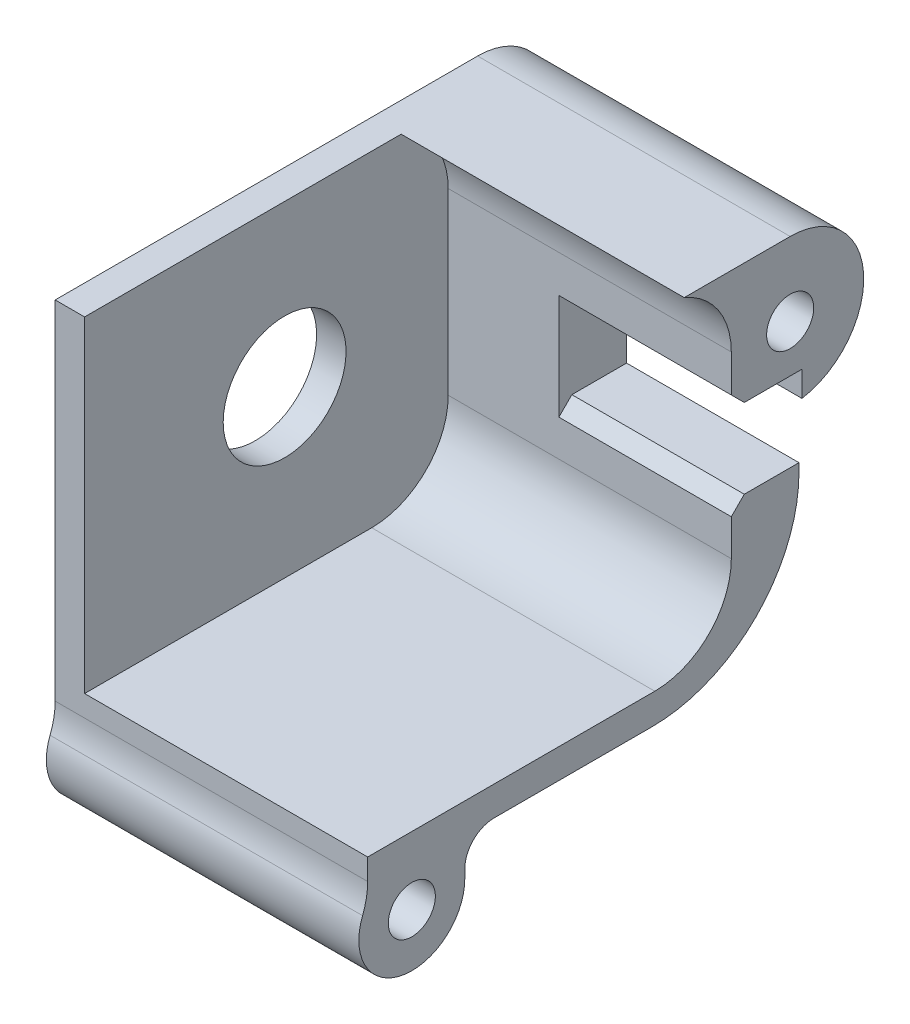
ISO-10303-21;
HEADER;
FILE_DESCRIPTION(('STEP AP214'),'2;1');
FILE_NAME('part.step','',(''),(''),'','','');
FILE_SCHEMA(('AUTOMOTIVE_DESIGN { 1 0 10303 214 1 1 1 1 }'));
ENDSEC;
DATA;
#1=APPLICATION_CONTEXT('core data for automotive mechanical design processes');
#2=APPLICATION_PROTOCOL_DEFINITION('international standard','automotive_design',2000,#1);
#3=PRODUCT_CONTEXT('',#1,'mechanical');
#4=PRODUCT('Part','Part','',(#3));
#5=PRODUCT_RELATED_PRODUCT_CATEGORY('part','',(#4));
#6=PRODUCT_DEFINITION_FORMATION('','',#4);
#7=PRODUCT_DEFINITION_CONTEXT('part definition',#1,'design');
#8=PRODUCT_DEFINITION('design','',#6,#7);
#9=PRODUCT_DEFINITION_SHAPE('','',#8);
#10=(LENGTH_UNIT() NAMED_UNIT(*) SI_UNIT(.MILLI.,.METRE.));
#11=(NAMED_UNIT(*) PLANE_ANGLE_UNIT() SI_UNIT($,.RADIAN.));
#12=(NAMED_UNIT(*) SI_UNIT($,.STERADIAN.) SOLID_ANGLE_UNIT());
#13=UNCERTAINTY_MEASURE_WITH_UNIT(LENGTH_MEASURE(1.E-05),#10,'distance_accuracy_value','');
#14=(GEOMETRIC_REPRESENTATION_CONTEXT(3) GLOBAL_UNCERTAINTY_ASSIGNED_CONTEXT((#13)) GLOBAL_UNIT_ASSIGNED_CONTEXT((#10,
#11,#12)) REPRESENTATION_CONTEXT('',''));
#15=CARTESIAN_POINT('',(0.,0.,0.));
#16=DIRECTION('',(0.,0.,1.));
#17=DIRECTION('',(1.,0.,0.));
#18=AXIS2_PLACEMENT_3D('',#15,#16,#17);
#19=CARTESIAN_POINT('',(-6497.9588402677,-3116.42691806672,-792.467150495456));
#20=DIRECTION('',(-1.,0.,0.));
#21=DIRECTION('',(0.,0.,1.));
#22=AXIS2_PLACEMENT_3D('',#19,#20,#21);
#23=CYLINDRICAL_SURFACE('',#22,1.59999999999944);
#24=CARTESIAN_POINT('',(-6553.50165117167,-3116.42691806672,-792.467150495456));
#25=DIRECTION('',(-1.,0.,0.));
#26=DIRECTION('',(0.,0.,1.));
#27=AXIS2_PLACEMENT_3D('',#24,#25,#26);
#28=CIRCLE('',#27,1.59999999999944);
#29=CARTESIAN_POINT('',(-6553.50165117167,-3116.42691806672,-790.867150495457));
#30=VERTEX_POINT('',#29);
#31=EDGE_CURVE('E455',#30,#30,#28,.T.);
#32=ORIENTED_EDGE('',*,*,#31,.T.);
#33=EDGE_LOOP('',(#32));
#34=FACE_BOUND('',#33,.T.);
#35=CARTESIAN_POINT('',(-6532.26164814562,-3116.42691806672,-792.467150495456));
#36=DIRECTION('',(-1.,0.,0.));
#37=DIRECTION('',(0.,0.,1.));
#38=AXIS2_PLACEMENT_3D('',#35,#36,#37);
#39=CIRCLE('',#38,1.59999999999944);
#40=CARTESIAN_POINT('',(-6532.26164814562,-3116.42691806672,-790.867150495457));
#41=VERTEX_POINT('',#40);
#42=EDGE_CURVE('E398',#41,#41,#39,.T.);
#43=ORIENTED_EDGE('',*,*,#42,.F.);
#44=EDGE_LOOP('',(#43));
#45=FACE_BOUND('',#44,.T.);
#46=ADVANCED_FACE('F205',(#34,#45),#23,.F.);
#47=CARTESIAN_POINT('',(-6497.9588402677,-3125.59483922505,-783.067150495456));
#48=DIRECTION('',(-1.,0.,0.));
#49=DIRECTION('',(0.,0.,1.));
#50=AXIS2_PLACEMENT_3D('',#47,#48,#49);
#51=CYLINDRICAL_SURFACE('',#50,9.9999999999999);
#52=DIRECTION('',(-1.,0.,0.));
#53=VECTOR('',#52,1.);
#54=CARTESIAN_POINT('',(-6497.9588402677,-3125.59483922505,-793.067150495456));
#55=LINE('',#54,#53);
#56=CARTESIAN_POINT('',(-6532.26164814562,-3125.59483922505,-793.067150495456));
#57=VERTEX_POINT('',#56);
#58=CARTESIAN_POINT('',(-6553.50165117167,-3125.59483922505,-793.067150495456));
#59=VERTEX_POINT('',#58);
#60=EDGE_CURVE('E209',#57,#59,#55,.T.);
#61=ORIENTED_EDGE('',*,*,#60,.F.);
#62=CARTESIAN_POINT('',(-6532.26164814562,-3125.59483922505,-783.067150495456));
#63=DIRECTION('',(-1.,0.,0.));
#64=DIRECTION('',(0.,0.,1.));
#65=AXIS2_PLACEMENT_3D('',#62,#63,#64);
#66=CIRCLE('',#65,9.9999999999999);
#67=CARTESIAN_POINT('',(-6532.26164814562,-3135.59483922505,-783.067150495456));
#68=VERTEX_POINT('',#67);
#69=EDGE_CURVE('E437',#57,#68,#66,.T.);
#70=ORIENTED_EDGE('',*,*,#69,.T.);
#71=DIRECTION('',(-1.,0.,0.));
#72=VECTOR('',#71,1.);
#73=CARTESIAN_POINT('',(-6497.9588402677,-3135.59483922505,-783.067150495456));
#74=LINE('',#73,#72);
#75=CARTESIAN_POINT('',(-6553.50165117167,-3135.59483922505,-783.067150495456));
#76=VERTEX_POINT('',#75);
#77=EDGE_CURVE('E539',#68,#76,#74,.T.);
#78=ORIENTED_EDGE('',*,*,#77,.T.);
#79=CARTESIAN_POINT('',(-6553.50165117167,-3125.59483922505,-783.067150495456));
#80=DIRECTION('',(-1.,0.,0.));
#81=DIRECTION('',(0.,0.,1.));
#82=AXIS2_PLACEMENT_3D('',#79,#80,#81);
#83=CIRCLE('',#82,9.9999999999999);
#84=EDGE_CURVE('E472',#59,#76,#83,.T.);
#85=ORIENTED_EDGE('',*,*,#84,.F.);
#86=EDGE_LOOP('',(#61,#70,#78,#85));
#87=FACE_BOUND('',#86,.T.);
#88=ADVANCED_FACE('F554',(#87),#51,.T.);
#89=CARTESIAN_POINT('',(-6497.9588402677,-3135.59483922505,0.));
#90=DIRECTION('',(0.,1.,0.));
#91=DIRECTION('',(0.,0.,1.));
#92=AXIS2_PLACEMENT_3D('',#89,#90,#91);
#93=PLANE('',#92);
#94=ORIENTED_EDGE('',*,*,#77,.F.);
#95=DIRECTION('',(0.,0.,-1.));
#96=VECTOR('',#95,1.);
#97=CARTESIAN_POINT('',(-6532.26164814562,-3135.59483922505,-793.067150495456));
#98=LINE('',#97,#96);
#99=CARTESIAN_POINT('',(-6532.26164814562,-3135.59483922505,-772.352150495456));
#100=VERTEX_POINT('',#99);
#101=EDGE_CURVE('E443',#100,#68,#98,.T.);
#102=ORIENTED_EDGE('',*,*,#101,.F.);
#103=DIRECTION('',(-1.,0.,0.));
#104=VECTOR('',#103,1.);
#105=CARTESIAN_POINT('',(-6497.9588402677,-3135.59483922505,-772.352150495456));
#106=LINE('',#105,#104);
#107=CARTESIAN_POINT('',(-6553.50165117167,-3135.59483922505,-772.352150495456));
#108=VERTEX_POINT('',#107);
#109=EDGE_CURVE('E538',#100,#108,#106,.T.);
#110=ORIENTED_EDGE('',*,*,#109,.T.);
#111=DIRECTION('',(0.,0.,1.));
#112=VECTOR('',#111,1.);
#113=CARTESIAN_POINT('',(-6553.50165117167,-3135.59483922505,0.));
#114=LINE('',#113,#112);
#115=EDGE_CURVE('E468',#76,#108,#114,.T.);
#116=ORIENTED_EDGE('',*,*,#115,.F.);
#117=EDGE_LOOP('',(#94,#102,#110,#116));
#118=FACE_BOUND('',#117,.T.);
#119=ADVANCED_FACE('F556',(#118),#93,.F.);
#120=CARTESIAN_POINT('',(-6497.9588402677,-3137.59483922505,-772.352150495456));
#121=DIRECTION('',(-1.,0.,0.));
#122=DIRECTION('',(0.,0.,1.));
#123=AXIS2_PLACEMENT_3D('',#120,#121,#122);
#124=CYLINDRICAL_SURFACE('',#123,1.99999999999989);
#125=ORIENTED_EDGE('',*,*,#109,.F.);
#126=CARTESIAN_POINT('',(-6532.26164814562,-3137.59483922505,-772.352150495456));
#127=DIRECTION('',(-1.,0.,0.));
#128=DIRECTION('',(0.,0.,1.));
#129=AXIS2_PLACEMENT_3D('',#126,#127,#128);
#130=CIRCLE('',#129,1.99999999999989);
#131=CARTESIAN_POINT('',(-6532.26164814562,-3137.59483922505,-770.352150495456));
#132=VERTEX_POINT('',#131);
#133=EDGE_CURVE('E440',#132,#100,#130,.T.);
#134=ORIENTED_EDGE('',*,*,#133,.F.);
#135=DIRECTION('',(-1.,0.,0.));
#136=VECTOR('',#135,1.);
#137=CARTESIAN_POINT('',(-6497.9588402677,-3137.59483922505,-770.352150495456));
#138=LINE('',#137,#136);
#139=CARTESIAN_POINT('',(-6553.50165117167,-3137.59483922505,-770.352150495456));
#140=VERTEX_POINT('',#139);
#141=EDGE_CURVE('E536',#132,#140,#138,.T.);
#142=ORIENTED_EDGE('',*,*,#141,.T.);
#143=CARTESIAN_POINT('',(-6553.50165117167,-3137.59483922505,-772.352150495456));
#144=DIRECTION('',(-1.,0.,0.));
#145=DIRECTION('',(0.,0.,1.));
#146=AXIS2_PLACEMENT_3D('',#143,#144,#145);
#147=CIRCLE('',#146,1.99999999999989);
#148=EDGE_CURVE('E465',#140,#108,#147,.T.);
#149=ORIENTED_EDGE('',*,*,#148,.T.);
#150=EDGE_LOOP('',(#125,#134,#142,#149));
#151=FACE_BOUND('',#150,.T.);
#152=ADVANCED_FACE('F561',(#151),#124,.F.);
#153=CARTESIAN_POINT('',(-6497.9588402677,0.,-770.352150495456));
#154=DIRECTION('',(0.,0.,1.));
#155=DIRECTION('',(1.,0.,0.));
#156=AXIS2_PLACEMENT_3D('',#153,#154,#155);
#157=PLANE('',#156);
#158=ORIENTED_EDGE('',*,*,#141,.F.);
#159=DIRECTION('',(0.,1.,0.));
#160=VECTOR('',#159,1.);
#161=CARTESIAN_POINT('',(-6532.26164814562,-3124.84191806672,-770.352150495456));
#162=LINE('',#161,#160);
#163=CARTESIAN_POINT('',(-6532.26164814562,-3138.19483922505,-770.352150495456));
#164=VERTEX_POINT('',#163);
#165=EDGE_CURVE('E434',#164,#132,#162,.T.);
#166=ORIENTED_EDGE('',*,*,#165,.F.);
#167=DIRECTION('',(-1.,0.,0.));
#168=VECTOR('',#167,1.);
#169=CARTESIAN_POINT('',(-6497.9588402677,-3138.19483922505,-770.352150495456));
#170=LINE('',#169,#168);
#171=CARTESIAN_POINT('',(-6553.50165117167,-3138.19483922505,-770.352150495456));
#172=VERTEX_POINT('',#171);
#173=EDGE_CURVE('E534',#164,#172,#170,.T.);
#174=ORIENTED_EDGE('',*,*,#173,.T.);
#175=DIRECTION('',(0.,-1.,0.));
#176=VECTOR('',#175,1.);
#177=CARTESIAN_POINT('',(-6553.50165117167,0.,-770.352150495456));
#178=LINE('',#177,#176);
#179=EDGE_CURVE('E492',#140,#172,#178,.T.);
#180=ORIENTED_EDGE('',*,*,#179,.F.);
#181=EDGE_LOOP('',(#158,#166,#174,#180));
#182=FACE_BOUND('',#181,.T.);
#183=ADVANCED_FACE('F569',(#182),#157,.F.);
#184=CARTESIAN_POINT('',(-6497.9588402677,-3138.19483922505,-766.752150495456));
#185=DIRECTION('',(-1.,0.,0.));
#186=DIRECTION('',(0.,0.,1.));
#187=AXIS2_PLACEMENT_3D('',#184,#185,#186);
#188=CYLINDRICAL_SURFACE('',#187,3.6000000000001);
#189=ORIENTED_EDGE('',*,*,#173,.F.);
#190=CARTESIAN_POINT('',(-6532.26164814562,-3138.19483922505,-766.752150495456));
#191=DIRECTION('',(-1.,0.,0.));
#192=DIRECTION('',(0.,0.,1.));
#193=AXIS2_PLACEMENT_3D('',#190,#191,#192);
#194=CIRCLE('',#193,3.6000000000001);
#195=CARTESIAN_POINT('',(-6532.26164814562,-3136.87374522931,-763.403313286154));
#196=VERTEX_POINT('',#195);
#197=EDGE_CURVE('E412',#164,#196,#194,.T.);
#198=ORIENTED_EDGE('',*,*,#197,.T.);
#199=DIRECTION('',(-1.,0.,0.));
#200=VECTOR('',#199,1.);
#201=CARTESIAN_POINT('',(-6497.9588402677,-3136.87374522931,-763.403313286154));
#202=LINE('',#201,#200);
#203=CARTESIAN_POINT('',(-6553.50165117167,-3136.87374522931,-763.403313286154));
#204=VERTEX_POINT('',#203);
#205=EDGE_CURVE('E532',#196,#204,#202,.T.);
#206=ORIENTED_EDGE('',*,*,#205,.T.);
#207=CARTESIAN_POINT('',(-6553.50165117167,-3138.19483922505,-766.752150495456));
#208=DIRECTION('',(-1.,0.,0.));
#209=DIRECTION('',(0.,0.,1.));
#210=AXIS2_PLACEMENT_3D('',#207,#208,#209);
#211=CIRCLE('',#210,3.6000000000001);
#212=EDGE_CURVE('E489',#172,#204,#211,.T.);
#213=ORIENTED_EDGE('',*,*,#212,.F.);
#214=EDGE_LOOP('',(#189,#198,#206,#213));
#215=FACE_BOUND('',#214,.T.);
#216=ADVANCED_FACE('F573',(#215),#188,.T.);
#217=CARTESIAN_POINT('',(-6497.9588402677,-3135.03889245744,-758.752150495456));
#218=DIRECTION('',(-1.,0.,0.));
#219=DIRECTION('',(0.,0.,1.));
#220=AXIS2_PLACEMENT_3D('',#217,#218,#219);
#221=CYLINDRICAL_SURFACE('',#220,4.99999999999993);
#222=ORIENTED_EDGE('',*,*,#205,.F.);
#223=CARTESIAN_POINT('',(-6532.26164814562,-3135.03889245744,-758.752150495456));
#224=DIRECTION('',(-1.,0.,0.));
#225=DIRECTION('',(0.,0.,1.));
#226=AXIS2_PLACEMENT_3D('',#223,#224,#225);
#227=CIRCLE('',#226,4.99999999999993);
#228=CARTESIAN_POINT('',(-6532.26164814562,-3135.03889245744,-763.752150495456));
#229=VERTEX_POINT('',#228);
#230=EDGE_CURVE('E431',#229,#196,#227,.T.);
#231=ORIENTED_EDGE('',*,*,#230,.F.);
#232=DIRECTION('',(-1.,0.,0.));
#233=VECTOR('',#232,1.);
#234=CARTESIAN_POINT('',(-6497.9588402677,-3135.03889245744,-763.752150495456));
#235=LINE('',#234,#233);
#236=CARTESIAN_POINT('',(-6553.50165117167,-3135.03889245744,-763.752150495456));
#237=VERTEX_POINT('',#236);
#238=EDGE_CURVE('E530',#229,#237,#235,.T.);
#239=ORIENTED_EDGE('',*,*,#238,.T.);
#240=CARTESIAN_POINT('',(-6553.50165117167,-3135.03889245744,-758.752150495456));
#241=DIRECTION('',(-1.,0.,0.));
#242=DIRECTION('',(0.,0.,1.));
#243=AXIS2_PLACEMENT_3D('',#240,#241,#242);
#244=CIRCLE('',#243,4.99999999999993);
#245=EDGE_CURVE('E486',#237,#204,#244,.T.);
#246=ORIENTED_EDGE('',*,*,#245,.T.);
#247=EDGE_LOOP('',(#222,#231,#239,#246));
#248=FACE_BOUND('',#247,.T.);
#249=ADVANCED_FACE('F577',(#248),#221,.F.);
#250=CARTESIAN_POINT('',(-6497.9588402677,0.,-763.752150495456));
#251=DIRECTION('',(0.,0.,-1.));
#252=DIRECTION('',(-1.,0.,0.));
#253=AXIS2_PLACEMENT_3D('',#250,#251,#252);
#254=PLANE('',#253);
#255=ORIENTED_EDGE('',*,*,#238,.F.);
#256=DIRECTION('',(0.,-1.,0.));
#257=VECTOR('',#256,1.);
#258=CARTESIAN_POINT('',(-6532.26164814562,-3124.84191806672,-763.752150495456));
#259=LINE('',#258,#257);
#260=CARTESIAN_POINT('',(-6532.26164814562,-3133.59483922505,-763.752150495456));
#261=VERTEX_POINT('',#260);
#262=EDGE_CURVE('E428',#261,#229,#259,.T.);
#263=ORIENTED_EDGE('',*,*,#262,.F.);
#264=DIRECTION('',(-1.,0.,0.));
#265=VECTOR('',#264,1.);
#266=CARTESIAN_POINT('',(-6497.9588402677,-3133.59483922505,-763.752150495456));
#267=LINE('',#266,#265);
#268=CARTESIAN_POINT('',(-6551.50165117167,-3133.59483922505,-763.752150495456));
#269=VERTEX_POINT('',#268);
#270=EDGE_CURVE('E528',#261,#269,#267,.T.);
#271=ORIENTED_EDGE('',*,*,#270,.T.);
#272=DIRECTION('',(0.,1.,0.));
#273=VECTOR('',#272,1.);
#274=CARTESIAN_POINT('',(-6551.50165117167,0.,-763.752150495456));
#275=LINE('',#274,#273);
#276=CARTESIAN_POINT('',(-6551.50165117167,-3111.42691806672,-763.752150495456));
#277=VERTEX_POINT('',#276);
#278=EDGE_CURVE('E469',#269,#277,#275,.T.);
#279=ORIENTED_EDGE('',*,*,#278,.T.);
#280=DIRECTION('',(1.,0.,0.));
#281=VECTOR('',#280,1.);
#282=CARTESIAN_POINT('',(-6553.50165117167,-3111.42691806672,-763.752150495456));
#283=LINE('',#282,#281);
#284=CARTESIAN_POINT('',(-6553.50165117167,-3111.42691806672,-763.752150495456));
#285=VERTEX_POINT('',#284);
#286=EDGE_CURVE('E495',#285,#277,#283,.T.);
#287=ORIENTED_EDGE('',*,*,#286,.F.);
#288=DIRECTION('',(0.,1.,0.));
#289=VECTOR('',#288,1.);
#290=CARTESIAN_POINT('',(-6553.50165117167,0.,-763.752150495456));
#291=LINE('',#290,#289);
#292=EDGE_CURVE('E484',#237,#285,#291,.T.);
#293=ORIENTED_EDGE('',*,*,#292,.F.);
#294=EDGE_LOOP('',(#255,#263,#271,#279,#287,#293));
#295=FACE_BOUND('',#294,.T.);
#296=ADVANCED_FACE('F581',(#295),#254,.F.);
#297=CARTESIAN_POINT('',(-6497.9588402677,-3133.59483922505,0.));
#298=DIRECTION('',(0.,-1.,0.));
#299=DIRECTION('',(0.,0.,-1.));
#300=AXIS2_PLACEMENT_3D('',#297,#298,#299);
#301=PLANE('',#300);
#302=ORIENTED_EDGE('',*,*,#270,.F.);
#303=DIRECTION('',(0.,0.,1.));
#304=VECTOR('',#303,1.);
#305=CARTESIAN_POINT('',(-6532.26164814562,-3133.59483922505,-793.067150495456));
#306=LINE('',#305,#304);
#307=CARTESIAN_POINT('',(-6532.26164814562,-3133.59483922505,-783.267150495456));
#308=VERTEX_POINT('',#307);
#309=EDGE_CURVE('E424',#308,#261,#306,.T.);
#310=ORIENTED_EDGE('',*,*,#309,.F.);
#311=DIRECTION('',(-1.,0.,0.));
#312=VECTOR('',#311,1.);
#313=CARTESIAN_POINT('',(-6497.9588402677,-3133.59483922505,-783.267150495456));
#314=LINE('',#313,#312);
#315=CARTESIAN_POINT('',(-6551.50165117167,-3133.59483922505,-783.267150495456));
#316=VERTEX_POINT('',#315);
#317=EDGE_CURVE('E526',#308,#316,#314,.T.);
#318=ORIENTED_EDGE('',*,*,#317,.T.);
#319=DIRECTION('',(0.,0.,1.));
#320=VECTOR('',#319,1.);
#321=CARTESIAN_POINT('',(-6551.50165117167,-3133.59483922505,0.));
#322=LINE('',#321,#320);
#323=EDGE_CURVE('E507',#316,#269,#322,.T.);
#324=ORIENTED_EDGE('',*,*,#323,.T.);
#325=EDGE_LOOP('',(#302,#310,#318,#324));
#326=FACE_BOUND('',#325,.T.);
#327=ADVANCED_FACE('F585',(#326),#301,.F.);
#328=CARTESIAN_POINT('',(-6497.9588402677,-3128.39483922505,-783.267150495456));
#329=DIRECTION('',(-1.,0.,0.));
#330=DIRECTION('',(0.,0.,1.));
#331=AXIS2_PLACEMENT_3D('',#328,#329,#330);
#332=CYLINDRICAL_SURFACE('',#331,5.19999999999993);
#333=ORIENTED_EDGE('',*,*,#317,.F.);
#334=CARTESIAN_POINT('',(-6532.26164814562,-3128.39483922505,-783.267150495456));
#335=DIRECTION('',(-1.,0.,0.));
#336=DIRECTION('',(0.,0.,1.));
#337=AXIS2_PLACEMENT_3D('',#334,#335,#336);
#338=CIRCLE('',#337,5.19999999999993);
#339=CARTESIAN_POINT('',(-6532.26164814562,-3128.39483922505,-788.467150495456));
#340=VERTEX_POINT('',#339);
#341=EDGE_CURVE('E421',#340,#308,#338,.T.);
#342=ORIENTED_EDGE('',*,*,#341,.F.);
#343=DIRECTION('',(-1.,0.,0.));
#344=VECTOR('',#343,1.);
#345=CARTESIAN_POINT('',(-6497.9588402677,-3128.39483922505,-788.467150495456));
#346=LINE('',#345,#344);
#347=CARTESIAN_POINT('',(-6551.50165117167,-3128.39483922505,-788.467150495456));
#348=VERTEX_POINT('',#347);
#349=EDGE_CURVE('E524',#340,#348,#346,.T.);
#350=ORIENTED_EDGE('',*,*,#349,.T.);
#351=CARTESIAN_POINT('',(-6551.50165117167,-3128.39483922505,-783.267150495456));
#352=DIRECTION('',(-1.,0.,0.));
#353=DIRECTION('',(0.,0.,1.));
#354=AXIS2_PLACEMENT_3D('',#351,#352,#353);
#355=CIRCLE('',#354,5.19999999999993);
#356=EDGE_CURVE('E510',#316,#348,#355,.F.);
#357=ORIENTED_EDGE('',*,*,#356,.F.);
#358=EDGE_LOOP('',(#333,#342,#350,#357));
#359=FACE_BOUND('',#358,.T.);
#360=ADVANCED_FACE('F589',(#359),#332,.F.);
#361=CARTESIAN_POINT('',(-6497.9588402677,0.,-788.467150495456));
#362=DIRECTION('',(0.,0.,1.));
#363=DIRECTION('',(1.,0.,0.));
#364=AXIS2_PLACEMENT_3D('',#361,#362,#363);
#365=PLANE('',#364);
#366=ORIENTED_EDGE('',*,*,#349,.F.);
#367=DIRECTION('',(0.,1.,0.));
#368=VECTOR('',#367,1.);
#369=CARTESIAN_POINT('',(-6532.26164814562,-3124.84191806672,-788.467150495456));
#370=LINE('',#369,#368);
#371=CARTESIAN_POINT('',(-6532.26164814562,-3125.92476077919,-788.467150495456));
#372=VERTEX_POINT('',#371);
#373=EDGE_CURVE('E404',#340,#372,#370,.T.);
#374=ORIENTED_EDGE('',*,*,#373,.T.);
#375=DIRECTION('',(-1.,0.,0.));
#376=VECTOR('',#375,1.);
#377=CARTESIAN_POINT('',(-6496.77509695806,-3125.92476077919,-788.467150495456));
#378=LINE('',#377,#376);
#379=CARTESIAN_POINT('',(-6543.98164965865,-3125.92476077919,-788.467150495456));
#380=VERTEX_POINT('',#379);
#381=EDGE_CURVE('E410',#372,#380,#378,.T.);
#382=ORIENTED_EDGE('',*,*,#381,.T.);
#383=DIRECTION('',(0.,1.,0.));
#384=VECTOR('',#383,1.);
#385=CARTESIAN_POINT('',(-6543.98164965865,0.,-788.467150495456));
#386=LINE('',#385,#384);
#387=CARTESIAN_POINT('',(-6543.98164965865,-3118.75907535424,-788.467150495456));
#388=VERTEX_POINT('',#387);
#389=EDGE_CURVE('E379',#380,#388,#386,.T.);
#390=ORIENTED_EDGE('',*,*,#389,.T.);
#391=DIRECTION('',(-1.,0.,0.));
#392=VECTOR('',#391,1.);
#393=CARTESIAN_POINT('',(-6496.77509695806,-3118.75907535424,-788.467150495456));
#394=LINE('',#393,#392);
#395=CARTESIAN_POINT('',(-6532.26164814562,-3118.75907535424,-788.467150495456));
#396=VERTEX_POINT('',#395);
#397=EDGE_CURVE('E370',#396,#388,#394,.T.);
#398=ORIENTED_EDGE('',*,*,#397,.F.);
#399=DIRECTION('',(0.,1.,0.));
#400=VECTOR('',#399,1.);
#401=CARTESIAN_POINT('',(-6532.26164814562,-3124.84191806672,-788.467150495456));
#402=LINE('',#401,#400);
#403=CARTESIAN_POINT('',(-6532.26164814562,-3116.22691806672,-788.467150495456));
#404=VERTEX_POINT('',#403);
#405=EDGE_CURVE('E354',#396,#404,#402,.T.);
#406=ORIENTED_EDGE('',*,*,#405,.T.);
#407=DIRECTION('',(-1.,0.,0.));
#408=VECTOR('',#407,1.);
#409=CARTESIAN_POINT('',(-6497.9588402677,-3116.22691806672,-788.467150495456));
#410=LINE('',#409,#408);
#411=CARTESIAN_POINT('',(-6551.50165117167,-3116.22691806672,-788.467150495456));
#412=VERTEX_POINT('',#411);
#413=EDGE_CURVE('E522',#404,#412,#410,.T.);
#414=ORIENTED_EDGE('',*,*,#413,.T.);
#415=DIRECTION('',(0.,1.,0.));
#416=VECTOR('',#415,1.);
#417=CARTESIAN_POINT('',(-6551.50165117167,0.,-788.467150495456));
#418=LINE('',#417,#416);
#419=EDGE_CURVE('E513',#348,#412,#418,.T.);
#420=ORIENTED_EDGE('',*,*,#419,.F.);
#421=EDGE_LOOP('',(#366,#374,#382,#390,#398,#406,#414,#420));
#422=FACE_BOUND('',#421,.T.);
#423=ADVANCED_FACE('F377',(#422),#365,.T.);
#424=CARTESIAN_POINT('',(-6497.9588402677,-3116.22691806672,-783.267150495456));
#425=DIRECTION('',(-1.,0.,0.));
#426=DIRECTION('',(0.,0.,1.));
#427=AXIS2_PLACEMENT_3D('',#424,#425,#426);
#428=CYLINDRICAL_SURFACE('',#427,5.19999999999998);
#429=ORIENTED_EDGE('',*,*,#413,.F.);
#430=CARTESIAN_POINT('',(-6532.26164814562,-3116.22691806672,-783.267150495456));
#431=DIRECTION('',(-1.,0.,0.));
#432=DIRECTION('',(0.,0.,1.));
#433=AXIS2_PLACEMENT_3D('',#430,#431,#432);
#434=CIRCLE('',#433,5.19999999999998);
#435=CARTESIAN_POINT('',(-6532.26164814562,-3111.42691806672,-785.267150495456));
#436=VERTEX_POINT('',#435);
#437=EDGE_CURVE('E362',#436,#404,#434,.T.);
#438=ORIENTED_EDGE('',*,*,#437,.F.);
#439=DIRECTION('',(-1.,0.,0.));
#440=VECTOR('',#439,1.);
#441=CARTESIAN_POINT('',(-6497.9588402677,-3111.42691806672,-785.267150495456));
#442=LINE('',#441,#440);
#443=CARTESIAN_POINT('',(-6551.50165117167,-3111.42691806672,-785.267150495456));
#444=VERTEX_POINT('',#443);
#445=EDGE_CURVE('E520',#436,#444,#442,.T.);
#446=ORIENTED_EDGE('',*,*,#445,.T.);
#447=CARTESIAN_POINT('',(-6551.50165117167,-3116.22691806672,-783.267150495456));
#448=DIRECTION('',(-1.,0.,0.));
#449=DIRECTION('',(0.,0.,1.));
#450=AXIS2_PLACEMENT_3D('',#447,#448,#449);
#451=CIRCLE('',#450,5.19999999999998);
#452=EDGE_CURVE('E516',#412,#444,#451,.F.);
#453=ORIENTED_EDGE('',*,*,#452,.F.);
#454=EDGE_LOOP('',(#429,#438,#446,#453));
#455=FACE_BOUND('',#454,.T.);
#456=ADVANCED_FACE('F596',(#455),#428,.F.);
#457=CARTESIAN_POINT('',(-6497.9588402677,-3111.4269180667,4.81194888229307E-11));
#458=DIRECTION('',(0.,-1.,0.));
#459=DIRECTION('',(0.,0.,-1.));
#460=AXIS2_PLACEMENT_3D('',#457,#458,#459);
#461=PLANE('',#460);
#462=ORIENTED_EDGE('',*,*,#445,.F.);
#463=DIRECTION('',(0.,0.,1.));
#464=VECTOR('',#463,1.);
#465=CARTESIAN_POINT('',(-6532.26164814562,-3111.42691806672,-793.067150495457));
#466=LINE('',#465,#464);
#467=CARTESIAN_POINT('',(-6532.26164814562,-3111.42691806672,-792.467150495456));
#468=VERTEX_POINT('',#467);
#469=EDGE_CURVE('E393',#468,#436,#466,.T.);
#470=ORIENTED_EDGE('',*,*,#469,.F.);
#471=DIRECTION('',(-1.,0.,0.));
#472=VECTOR('',#471,1.);
#473=CARTESIAN_POINT('',(-6497.9588402677,-3111.42691806672,-792.467150495456));
#474=LINE('',#473,#472);
#475=CARTESIAN_POINT('',(-6553.50165117167,-3111.42691806672,-792.467150495456));
#476=VERTEX_POINT('',#475);
#477=EDGE_CURVE('E214',#468,#476,#474,.T.);
#478=ORIENTED_EDGE('',*,*,#477,.T.);
#479=DIRECTION('',(0.,0.,-1.));
#480=VECTOR('',#479,1.);
#481=CARTESIAN_POINT('',(-6553.50165117167,-3111.4269180667,4.81194888229307E-11));
#482=LINE('',#481,#480);
#483=EDGE_CURVE('E481',#285,#476,#482,.T.);
#484=ORIENTED_EDGE('',*,*,#483,.F.);
#485=ORIENTED_EDGE('',*,*,#286,.T.);
#486=DIRECTION('',(0.,0.,-1.));
#487=VECTOR('',#486,1.);
#488=CARTESIAN_POINT('',(-6551.50165117167,-3111.4269180667,4.81194888229307E-11));
#489=LINE('',#488,#487);
#490=EDGE_CURVE('E462',#277,#444,#489,.T.);
#491=ORIENTED_EDGE('',*,*,#490,.T.);
#492=EDGE_LOOP('',(#462,#470,#478,#484,#485,#491));
#493=FACE_BOUND('',#492,.T.);
#494=ADVANCED_FACE('F599',(#493),#461,.F.);
#495=CARTESIAN_POINT('',(-6497.9588402677,-3116.42691806672,-792.467150495456));
#496=DIRECTION('',(-1.,0.,0.));
#497=DIRECTION('',(0.,0.,1.));
#498=AXIS2_PLACEMENT_3D('',#495,#496,#497);
#499=CYLINDRICAL_SURFACE('',#498,4.99999999999998);
#500=CARTESIAN_POINT('',(-6543.98164965865,-3116.42691806672,-792.467150495456));
#501=DIRECTION('',(1.,0.,0.));
#502=DIRECTION('',(0.,0.,-1.));
#503=AXIS2_PLACEMENT_3D('',#500,#501,#502);
#504=CIRCLE('',#503,4.99999999999998);
#505=CARTESIAN_POINT('',(-6543.98164965865,-3121.39078752511,-793.067150495456));
#506=VERTEX_POINT('',#505);
#507=CARTESIAN_POINT('',(-6543.98164965865,-3121.36250313842,-793.267150495456));
#508=VERTEX_POINT('',#507);
#509=EDGE_CURVE('E502',#506,#508,#504,.T.);
#510=ORIENTED_EDGE('',*,*,#509,.F.);
#511=DIRECTION('',(-1.,0.,0.));
#512=VECTOR('',#511,1.);
#513=CARTESIAN_POINT('',(-6497.9588402677,-3121.39078752511,-793.067150495456));
#514=LINE('',#513,#512);
#515=CARTESIAN_POINT('',(-6553.50165117167,-3121.39078752511,-793.067150495456));
#516=VERTEX_POINT('',#515);
#517=EDGE_CURVE('E13',#506,#516,#514,.T.);
#518=ORIENTED_EDGE('',*,*,#517,.T.);
#519=CARTESIAN_POINT('',(-6553.50165117167,-3116.42691806672,-792.467150495456));
#520=DIRECTION('',(-1.,0.,0.));
#521=DIRECTION('',(0.,0.,1.));
#522=AXIS2_PLACEMENT_3D('',#519,#520,#521);
#523=CIRCLE('',#522,4.99999999999998);
#524=EDGE_CURVE('E478',#476,#516,#523,.T.);
#525=ORIENTED_EDGE('',*,*,#524,.F.);
#526=ORIENTED_EDGE('',*,*,#477,.F.);
#527=CARTESIAN_POINT('',(-6532.26164814562,-3116.42691806672,-792.467150495456));
#528=DIRECTION('',(-1.,0.,0.));
#529=DIRECTION('',(0.,0.,1.));
#530=AXIS2_PLACEMENT_3D('',#527,#528,#529);
#531=CIRCLE('',#530,4.99999999999998);
#532=CARTESIAN_POINT('',(-6532.26164814562,-3121.36250313842,-793.267150495456));
#533=VERTEX_POINT('',#532);
#534=EDGE_CURVE('E394',#468,#533,#531,.T.);
#535=ORIENTED_EDGE('',*,*,#534,.T.);
#536=DIRECTION('',(-1.,0.,0.));
#537=VECTOR('',#536,1.);
#538=CARTESIAN_POINT('',(-6496.77509695806,-3121.36250313842,-793.267150495456));
#539=LINE('',#538,#537);
#540=EDGE_CURVE('E365',#533,#508,#539,.T.);
#541=ORIENTED_EDGE('',*,*,#540,.T.);
#542=EDGE_LOOP('',(#510,#518,#525,#526,#535,#541));
#543=FACE_BOUND('',#542,.T.);
#544=ADVANCED_FACE('F603',(#543),#499,.T.);
#545=CARTESIAN_POINT('',(-6497.9588402677,-2.0943638979661E-11,-793.067150495539));
#546=DIRECTION('',(0.,0.,1.));
#547=DIRECTION('',(0.,-1.,0.));
#548=AXIS2_PLACEMENT_3D('',#545,#546,#547);
#549=PLANE('',#548);
#550=DIRECTION('',(0.,1.,0.));
#551=VECTOR('',#550,1.);
#552=CARTESIAN_POINT('',(-6543.98164965865,-2.0943638979661E-11,-793.067150495539));
#553=LINE('',#552,#551);
#554=CARTESIAN_POINT('',(-6543.98164965865,-3125.04191806672,-793.067150495456));
#555=VERTEX_POINT('',#554);
#556=EDGE_CURVE('E505',#555,#506,#553,.T.);
#557=ORIENTED_EDGE('',*,*,#556,.F.);
#558=DIRECTION('',(-1.,0.,0.));
#559=VECTOR('',#558,1.);
#560=CARTESIAN_POINT('',(-6496.77509695806,-3125.04191806672,-793.067150495456));
#561=LINE('',#560,#559);
#562=CARTESIAN_POINT('',(-6532.26164814562,-3125.04191806672,-793.067150495456));
#563=VERTEX_POINT('',#562);
#564=EDGE_CURVE('E408',#563,#555,#561,.T.);
#565=ORIENTED_EDGE('',*,*,#564,.F.);
#566=DIRECTION('',(0.,1.,0.));
#567=VECTOR('',#566,1.);
#568=CARTESIAN_POINT('',(-6532.26164814562,-3124.84191806672,-793.067150495456));
#569=LINE('',#568,#567);
#570=EDGE_CURVE('E446',#57,#563,#569,.T.);
#571=ORIENTED_EDGE('',*,*,#570,.F.);
#572=ORIENTED_EDGE('',*,*,#60,.T.);
#573=DIRECTION('',(0.,-1.,0.));
#574=VECTOR('',#573,1.);
#575=CARTESIAN_POINT('',(-6553.50165117167,-2.0943638979661E-11,-793.067150495539));
#576=LINE('',#575,#574);
#577=EDGE_CURVE('E475',#516,#59,#576,.T.);
#578=ORIENTED_EDGE('',*,*,#577,.F.);
#579=ORIENTED_EDGE('',*,*,#517,.F.);
#580=EDGE_LOOP('',(#557,#565,#571,#572,#578,#579));
#581=FACE_BOUND('',#580,.T.);
#582=ADVANCED_FACE('F207',(#581),#549,.F.);
#583=CARTESIAN_POINT('',(-6497.9588402677,-3138.19483922505,-766.752150495456));
#584=DIRECTION('',(-1.,0.,0.));
#585=DIRECTION('',(0.,0.,1.));
#586=AXIS2_PLACEMENT_3D('',#583,#584,#585);
#587=CYLINDRICAL_SURFACE('',#586,1.59999999999944);
#588=CARTESIAN_POINT('',(-6553.50165117167,-3138.19483922505,-766.752150495456));
#589=DIRECTION('',(-1.,0.,0.));
#590=DIRECTION('',(0.,0.,1.));
#591=AXIS2_PLACEMENT_3D('',#588,#589,#590);
#592=CIRCLE('',#591,1.59999999999944);
#593=CARTESIAN_POINT('',(-6553.50165117167,-3138.19483922505,-765.152150495457));
#594=VERTEX_POINT('',#593);
#595=EDGE_CURVE('E450',#594,#594,#592,.T.);
#596=ORIENTED_EDGE('',*,*,#595,.T.);
#597=EDGE_LOOP('',(#596));
#598=FACE_BOUND('',#597,.T.);
#599=CARTESIAN_POINT('',(-6532.26164814562,-3138.19483922505,-766.752150495456));
#600=DIRECTION('',(-1.,0.,0.));
#601=DIRECTION('',(0.,0.,1.));
#602=AXIS2_PLACEMENT_3D('',#599,#600,#601);
#603=CIRCLE('',#602,1.59999999999944);
#604=CARTESIAN_POINT('',(-6532.26164814562,-3138.19483922505,-765.152150495457));
#605=VERTEX_POINT('',#604);
#606=EDGE_CURVE('E425',#605,#605,#603,.T.);
#607=ORIENTED_EDGE('',*,*,#606,.F.);
#608=EDGE_LOOP('',(#607));
#609=FACE_BOUND('',#608,.T.);
#610=ADVANCED_FACE('F608',(#598,#609),#587,.F.);
#611=CARTESIAN_POINT('',(-6543.98164965865,-3124.84191806672,-793.067150495456));
#612=DIRECTION('',(1.,0.,0.));
#613=DIRECTION('',(0.,0.,-1.));
#614=AXIS2_PLACEMENT_3D('',#611,#612,#613);
#615=PLANE('',#614);
#616=DIRECTION('',(0.,0.707106781186503,0.707106781186592));
#617=VECTOR('',#616,1.);
#618=CARTESIAN_POINT('',(-6543.98164965865,-3124.10049671048,-793.808571851694));
#619=LINE('',#618,#617);
#620=CARTESIAN_POINT('',(-6543.98164965865,-3119.64191806672,-789.349993207931));
#621=VERTEX_POINT('',#620);
#622=EDGE_CURVE('E660',#621,#388,#619,.T.);
#623=ORIENTED_EDGE('',*,*,#622,.T.);
#624=ORIENTED_EDGE('',*,*,#389,.F.);
#625=DIRECTION('',(0.,-0.707106781186503,0.707106781186592));
#626=VECTOR('',#625,1.);
#627=CARTESIAN_POINT('',(-6543.98164965865,-3123.08333942295,-791.308571851694));
#628=LINE('',#627,#626);
#629=CARTESIAN_POINT('',(-6543.98164965865,-3125.04191806672,-789.349993207931));
#630=VERTEX_POINT('',#629);
#631=EDGE_CURVE('E222',#630,#380,#628,.T.);
#632=ORIENTED_EDGE('',*,*,#631,.F.);
#633=DIRECTION('',(0.,0.,1.));
#634=VECTOR('',#633,1.);
#635=CARTESIAN_POINT('',(-6543.98164965865,-3125.04191806672,-793.067150495456));
#636=LINE('',#635,#634);
#637=EDGE_CURVE('E227',#555,#630,#636,.T.);
#638=ORIENTED_EDGE('',*,*,#637,.F.);
#639=ORIENTED_EDGE('',*,*,#556,.T.);
#640=ORIENTED_EDGE('',*,*,#509,.T.);
#641=DIRECTION('',(0.,1.,0.));
#642=VECTOR('',#641,1.);
#643=CARTESIAN_POINT('',(-6543.98164965865,-3124.84191806672,-793.267150495456));
#644=LINE('',#643,#642);
#645=CARTESIAN_POINT('',(-6543.98164965865,-3119.64191806672,-793.267150495456));
#646=VERTEX_POINT('',#645);
#647=EDGE_CURVE('E385',#508,#646,#644,.T.);
#648=ORIENTED_EDGE('',*,*,#647,.T.);
#649=DIRECTION('',(0.,0.,1.));
#650=VECTOR('',#649,1.);
#651=CARTESIAN_POINT('',(-6543.98164965865,-3119.64191806672,-793.067150495456));
#652=LINE('',#651,#650);
#653=EDGE_CURVE('E380',#646,#621,#652,.T.);
#654=ORIENTED_EDGE('',*,*,#653,.T.);
#655=EDGE_LOOP('',(#623,#624,#632,#638,#639,#640,#648,#654));
#656=FACE_BOUND('',#655,.T.);
#657=ADVANCED_FACE('F611',(#656),#615,.T.);
#658=CARTESIAN_POINT('',(-6553.50165117167,-3137.59483922505,-772.352150495456));
#659=DIRECTION('',(-1.,0.,0.));
#660=DIRECTION('',(0.,0.,1.));
#661=AXIS2_PLACEMENT_3D('',#658,#659,#660);
#662=PLANE('',#661);
#663=ORIENTED_EDGE('',*,*,#31,.F.);
#664=EDGE_LOOP('',(#663));
#665=FACE_BOUND('',#664,.T.);
#666=ORIENTED_EDGE('',*,*,#148,.F.);
#667=ORIENTED_EDGE('',*,*,#179,.T.);
#668=ORIENTED_EDGE('',*,*,#212,.T.);
#669=ORIENTED_EDGE('',*,*,#245,.F.);
#670=ORIENTED_EDGE('',*,*,#292,.T.);
#671=ORIENTED_EDGE('',*,*,#483,.T.);
#672=ORIENTED_EDGE('',*,*,#524,.T.);
#673=ORIENTED_EDGE('',*,*,#577,.T.);
#674=ORIENTED_EDGE('',*,*,#84,.T.);
#675=ORIENTED_EDGE('',*,*,#115,.T.);
#676=EDGE_LOOP('',(#666,#667,#668,#669,#670,#671,#672,#673,#674,#675));
#677=FACE_BOUND('',#676,.T.);
#678=CARTESIAN_POINT('',(-6553.50165117167,-3122.34191806672,-777.347150495457));
#679=DIRECTION('',(-1.,0.,0.));
#680=DIRECTION('',(0.,0.,1.));
#681=AXIS2_PLACEMENT_3D('',#678,#679,#680);
#682=CIRCLE('',#681,4.17500000000048);
#683=CARTESIAN_POINT('',(-6553.50165117167,-3122.34191806672,-773.172150495456));
#684=VERTEX_POINT('',#683);
#685=EDGE_CURVE('E459',#684,#684,#682,.T.);
#686=ORIENTED_EDGE('',*,*,#685,.F.);
#687=EDGE_LOOP('',(#686));
#688=FACE_BOUND('',#687,.T.);
#689=ORIENTED_EDGE('',*,*,#595,.F.);
#690=EDGE_LOOP('',(#689));
#691=FACE_BOUND('',#690,.T.);
#692=ADVANCED_FACE('F550',(#665,#677,#688,#691),#662,.T.);
#693=CARTESIAN_POINT('',(-6551.50165117167,-3137.59483922505,-772.352150495456));
#694=DIRECTION('',(-1.,0.,0.));
#695=DIRECTION('',(0.,0.,1.));
#696=AXIS2_PLACEMENT_3D('',#693,#694,#695);
#697=PLANE('',#696);
#698=ORIENTED_EDGE('',*,*,#323,.F.);
#699=ORIENTED_EDGE('',*,*,#356,.T.);
#700=ORIENTED_EDGE('',*,*,#419,.T.);
#701=ORIENTED_EDGE('',*,*,#452,.T.);
#702=ORIENTED_EDGE('',*,*,#490,.F.);
#703=ORIENTED_EDGE('',*,*,#278,.F.);
#704=EDGE_LOOP('',(#698,#699,#700,#701,#702,#703));
#705=FACE_BOUND('',#704,.T.);
#706=CARTESIAN_POINT('',(-6551.50165117167,-3122.34191806672,-777.347150495457));
#707=DIRECTION('',(-1.,0.,0.));
#708=DIRECTION('',(0.,0.,1.));
#709=AXIS2_PLACEMENT_3D('',#706,#707,#708);
#710=CIRCLE('',#709,4.17500000000048);
#711=CARTESIAN_POINT('',(-6551.50165117167,-3122.34191806672,-773.172150495456));
#712=VERTEX_POINT('',#711);
#713=EDGE_CURVE('E458',#712,#712,#710,.T.);
#714=ORIENTED_EDGE('',*,*,#713,.T.);
#715=EDGE_LOOP('',(#714));
#716=FACE_BOUND('',#715,.T.);
#717=ADVANCED_FACE('F615',(#705,#716),#697,.F.);
#718=CARTESIAN_POINT('',(-6553.50165117167,-3122.34191806672,-777.347150495457));
#719=DIRECTION('',(1.,0.,0.));
#720=DIRECTION('',(0.,0.,-1.));
#721=AXIS2_PLACEMENT_3D('',#718,#719,#720);
#722=CYLINDRICAL_SURFACE('',#721,4.17500000000048);
#723=ORIENTED_EDGE('',*,*,#685,.T.);
#724=EDGE_LOOP('',(#723));
#725=FACE_BOUND('',#724,.T.);
#726=ORIENTED_EDGE('',*,*,#713,.F.);
#727=EDGE_LOOP('',(#726));
#728=FACE_BOUND('',#727,.T.);
#729=ADVANCED_FACE('F618',(#725,#728),#722,.F.);
#730=CARTESIAN_POINT('',(-6496.77509695806,-3125.04191806672,-793.067150495456));
#731=DIRECTION('',(0.,-1.,0.));
#732=DIRECTION('',(0.,0.,-1.));
#733=AXIS2_PLACEMENT_3D('',#730,#731,#732);
#734=PLANE('',#733);
#735=DIRECTION('',(-1.,0.,0.));
#736=VECTOR('',#735,1.);
#737=CARTESIAN_POINT('',(-6496.77509695806,-3125.04191806672,-789.349993207931));
#738=LINE('',#737,#736);
#739=CARTESIAN_POINT('',(-6532.26164814562,-3125.04191806672,-789.349993207931));
#740=VERTEX_POINT('',#739);
#741=EDGE_CURVE('E405',#740,#630,#738,.T.);
#742=ORIENTED_EDGE('',*,*,#741,.F.);
#743=DIRECTION('',(0.,0.,-1.));
#744=VECTOR('',#743,1.);
#745=CARTESIAN_POINT('',(-6532.26164814562,-3125.04191806672,-793.067150495456));
#746=LINE('',#745,#744);
#747=EDGE_CURVE('E402',#740,#563,#746,.T.);
#748=ORIENTED_EDGE('',*,*,#747,.T.);
#749=ORIENTED_EDGE('',*,*,#564,.T.);
#750=ORIENTED_EDGE('',*,*,#637,.T.);
#751=EDGE_LOOP('',(#742,#748,#749,#750));
#752=FACE_BOUND('',#751,.T.);
#753=ADVANCED_FACE('F625',(#752),#734,.F.);
#754=CARTESIAN_POINT('',(-6496.77509695806,-3123.08333942295,-791.308571851694));
#755=DIRECTION('',(0.,-0.707106781186592,-0.707106781186503));
#756=DIRECTION('',(0.,0.707106781186503,-0.707106781186592));
#757=AXIS2_PLACEMENT_3D('',#754,#755,#756);
#758=PLANE('',#757);
#759=ORIENTED_EDGE('',*,*,#381,.F.);
#760=DIRECTION('',(0.,0.707106781186503,-0.707106781186592));
#761=VECTOR('',#760,1.);
#762=CARTESIAN_POINT('',(-6532.26164814562,-3123.08333942295,-791.308571851694));
#763=LINE('',#762,#761);
#764=EDGE_CURVE('E407',#372,#740,#763,.T.);
#765=ORIENTED_EDGE('',*,*,#764,.T.);
#766=ORIENTED_EDGE('',*,*,#741,.T.);
#767=ORIENTED_EDGE('',*,*,#631,.T.);
#768=EDGE_LOOP('',(#759,#765,#766,#767));
#769=FACE_BOUND('',#768,.T.);
#770=ADVANCED_FACE('F630',(#769),#758,.F.);
#771=CARTESIAN_POINT('',(-6532.26164814562,-3115.97691806672,-740.067150495456));
#772=DIRECTION('',(-1.,0.,0.));
#773=DIRECTION('',(0.,0.,-1.));
#774=AXIS2_PLACEMENT_3D('',#771,#772,#773);
#775=PLANE('',#774);
#776=ORIENTED_EDGE('',*,*,#606,.T.);
#777=EDGE_LOOP('',(#776));
#778=FACE_BOUND('',#777,.T.);
#779=ORIENTED_EDGE('',*,*,#764,.F.);
#780=ORIENTED_EDGE('',*,*,#373,.F.);
#781=ORIENTED_EDGE('',*,*,#341,.T.);
#782=ORIENTED_EDGE('',*,*,#309,.T.);
#783=ORIENTED_EDGE('',*,*,#262,.T.);
#784=ORIENTED_EDGE('',*,*,#230,.T.);
#785=ORIENTED_EDGE('',*,*,#197,.F.);
#786=ORIENTED_EDGE('',*,*,#165,.T.);
#787=ORIENTED_EDGE('',*,*,#133,.T.);
#788=ORIENTED_EDGE('',*,*,#101,.T.);
#789=ORIENTED_EDGE('',*,*,#69,.F.);
#790=ORIENTED_EDGE('',*,*,#570,.T.);
#791=ORIENTED_EDGE('',*,*,#747,.F.);
#792=EDGE_LOOP('',(#779,#780,#781,#782,#783,#784,#785,#786,#787,#788,#789,#790,#791));
#793=FACE_BOUND('',#792,.T.);
#794=ADVANCED_FACE('F627',(#778,#793),#775,.F.);
#795=CARTESIAN_POINT('',(-6496.77509695806,-3124.10049671048,-793.808571851694));
#796=DIRECTION('',(0.,-0.707106781186592,0.707106781186503));
#797=DIRECTION('',(0.,-0.707106781186503,-0.707106781186592));
#798=AXIS2_PLACEMENT_3D('',#795,#796,#797);
#799=PLANE('',#798);
#800=DIRECTION('',(0.,-0.707106781186503,-0.707106781186592));
#801=VECTOR('',#800,1.);
#802=CARTESIAN_POINT('',(-6532.26164814562,-3124.10049671048,-793.808571851694));
#803=LINE('',#802,#801);
#804=CARTESIAN_POINT('',(-6532.26164814562,-3119.64191806672,-789.349993207931));
#805=VERTEX_POINT('',#804);
#806=EDGE_CURVE('E358',#396,#805,#803,.T.);
#807=ORIENTED_EDGE('',*,*,#806,.F.);
#808=ORIENTED_EDGE('',*,*,#397,.T.);
#809=ORIENTED_EDGE('',*,*,#622,.F.);
#810=DIRECTION('',(-1.,0.,0.));
#811=VECTOR('',#810,1.);
#812=CARTESIAN_POINT('',(-6496.77509695806,-3119.64191806672,-789.349993207931));
#813=LINE('',#812,#811);
#814=EDGE_CURVE('E372',#805,#621,#813,.T.);
#815=ORIENTED_EDGE('',*,*,#814,.F.);
#816=EDGE_LOOP('',(#807,#808,#809,#815));
#817=FACE_BOUND('',#816,.T.);
#818=ADVANCED_FACE('F368',(#817),#799,.T.);
#819=CARTESIAN_POINT('',(-6496.77509695806,-3119.64191806672,-793.067150495456));
#820=DIRECTION('',(0.,-1.,0.));
#821=DIRECTION('',(0.,0.,-1.));
#822=AXIS2_PLACEMENT_3D('',#819,#820,#821);
#823=PLANE('',#822);
#824=DIRECTION('',(0.,0.,-1.));
#825=VECTOR('',#824,1.);
#826=CARTESIAN_POINT('',(-6532.26164814562,-3119.64191806672,-793.067150495456));
#827=LINE('',#826,#825);
#828=CARTESIAN_POINT('',(-6532.26164814562,-3119.64191806672,-793.267150495456));
#829=VERTEX_POINT('',#828);
#830=EDGE_CURVE('E374',#805,#829,#827,.T.);
#831=ORIENTED_EDGE('',*,*,#830,.F.);
#832=ORIENTED_EDGE('',*,*,#814,.T.);
#833=ORIENTED_EDGE('',*,*,#653,.F.);
#834=DIRECTION('',(-1.,0.,0.));
#835=VECTOR('',#834,1.);
#836=CARTESIAN_POINT('',(-6496.77509695806,-3119.64191806672,-793.267150495456));
#837=LINE('',#836,#835);
#838=EDGE_CURVE('E382',#829,#646,#837,.T.);
#839=ORIENTED_EDGE('',*,*,#838,.F.);
#840=EDGE_LOOP('',(#831,#832,#833,#839));
#841=FACE_BOUND('',#840,.T.);
#842=ADVANCED_FACE('F643',(#841),#823,.T.);
#843=CARTESIAN_POINT('',(-6496.77509695806,-3124.84191806672,-793.267150495456));
#844=DIRECTION('',(0.,0.,1.));
#845=DIRECTION('',(1.,0.,0.));
#846=AXIS2_PLACEMENT_3D('',#843,#844,#845);
#847=PLANE('',#846);
#848=DIRECTION('',(0.,-1.,0.));
#849=VECTOR('',#848,1.);
#850=CARTESIAN_POINT('',(-6532.26164814562,-3124.84191806672,-793.267150495456));
#851=LINE('',#850,#849);
#852=EDGE_CURVE('E391',#829,#533,#851,.T.);
#853=ORIENTED_EDGE('',*,*,#852,.F.);
#854=ORIENTED_EDGE('',*,*,#838,.T.);
#855=ORIENTED_EDGE('',*,*,#647,.F.);
#856=ORIENTED_EDGE('',*,*,#540,.F.);
#857=EDGE_LOOP('',(#853,#854,#855,#856));
#858=FACE_BOUND('',#857,.T.);
#859=ADVANCED_FACE('F640',(#858),#847,.T.);
#860=CARTESIAN_POINT('',(-6532.26164814562,-3115.97691806672,-740.067150495456));
#861=DIRECTION('',(-1.,0.,0.));
#862=DIRECTION('',(0.,0.,-1.));
#863=AXIS2_PLACEMENT_3D('',#860,#861,#862);
#864=PLANE('',#863);
#865=ORIENTED_EDGE('',*,*,#806,.T.);
#866=ORIENTED_EDGE('',*,*,#830,.T.);
#867=ORIENTED_EDGE('',*,*,#852,.T.);
#868=ORIENTED_EDGE('',*,*,#534,.F.);
#869=ORIENTED_EDGE('',*,*,#469,.T.);
#870=ORIENTED_EDGE('',*,*,#437,.T.);
#871=ORIENTED_EDGE('',*,*,#405,.F.);
#872=EDGE_LOOP('',(#865,#866,#867,#868,#869,#870,#871));
#873=FACE_BOUND('',#872,.T.);
#874=ORIENTED_EDGE('',*,*,#42,.T.);
#875=EDGE_LOOP('',(#874));
#876=FACE_BOUND('',#875,.T.);
#877=ADVANCED_FACE('F356',(#873,#876),#864,.F.);
#878=CLOSED_SHELL('',(#46,#88,#119,#152,#183,#216,#249,#296,#327,#360,#423,#456,#494,#544,#582,
#610,#657,#692,#717,#729,#753,#770,#794,#818,#842,#859,#877));
#879=MANIFOLD_SOLID_BREP('B2',#878);
#880=ADVANCED_BREP_SHAPE_REPRESENTATION('',(#18,#879),#14);
#881=SHAPE_DEFINITION_REPRESENTATION(#9,#880);
ENDSEC;
END-ISO-10303-21;
